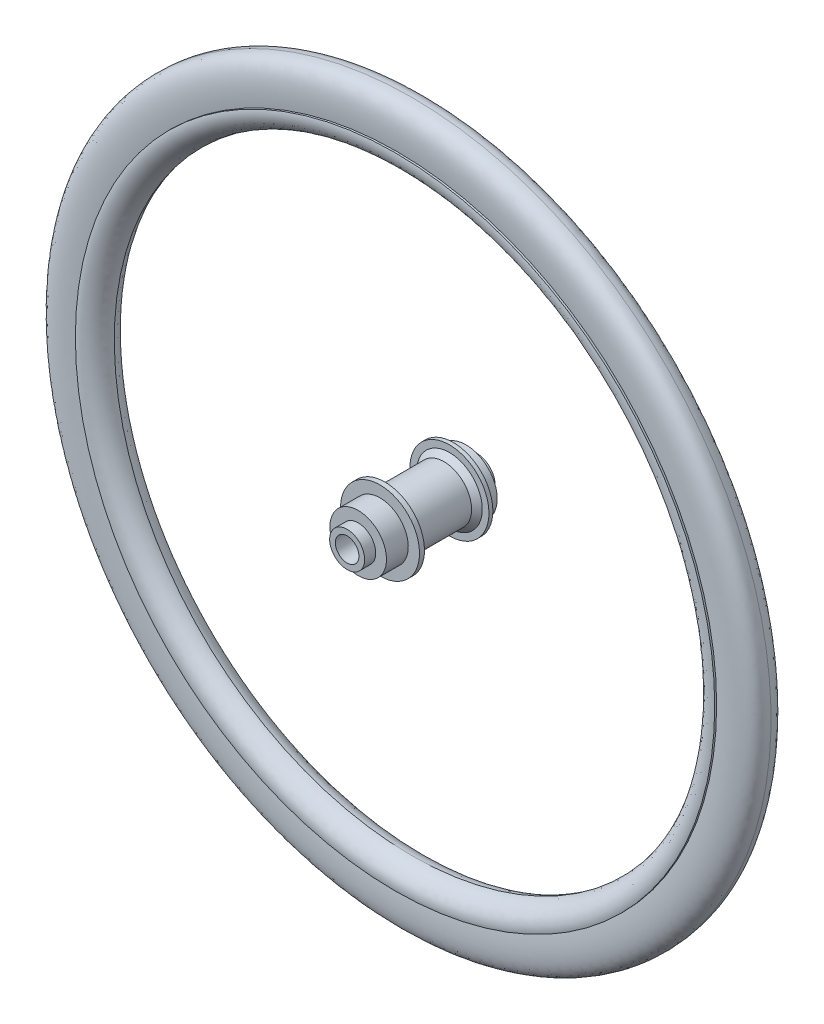
ISO-10303-21;
HEADER;
FILE_DESCRIPTION(('STEP AP214'),'2;1');
FILE_NAME('part.step','',(''),(''),'','','');
FILE_SCHEMA(('AUTOMOTIVE_DESIGN { 1 0 10303 214 1 1 1 1 }'));
ENDSEC;
DATA;
#1=APPLICATION_CONTEXT('core data for automotive mechanical design processes');
#2=APPLICATION_PROTOCOL_DEFINITION('international standard','automotive_design',2000,#1);
#3=PRODUCT_CONTEXT('',#1,'mechanical');
#4=PRODUCT('Part','Part','',(#3));
#5=PRODUCT_RELATED_PRODUCT_CATEGORY('part','',(#4));
#6=PRODUCT_DEFINITION_FORMATION('','',#4);
#7=PRODUCT_DEFINITION_CONTEXT('part definition',#1,'design');
#8=PRODUCT_DEFINITION('design','',#6,#7);
#9=PRODUCT_DEFINITION_SHAPE('','',#8);
#10=(LENGTH_UNIT() NAMED_UNIT(*) SI_UNIT(.MILLI.,.METRE.));
#11=(NAMED_UNIT(*) PLANE_ANGLE_UNIT() SI_UNIT($,.RADIAN.));
#12=(NAMED_UNIT(*) SI_UNIT($,.STERADIAN.) SOLID_ANGLE_UNIT());
#13=UNCERTAINTY_MEASURE_WITH_UNIT(LENGTH_MEASURE(1.E-05),#10,'distance_accuracy_value','');
#14=(GEOMETRIC_REPRESENTATION_CONTEXT(3) GLOBAL_UNCERTAINTY_ASSIGNED_CONTEXT((#13)) GLOBAL_UNIT_ASSIGNED_CONTEXT((#10,
#11,#12)) REPRESENTATION_CONTEXT('',''));
#15=CARTESIAN_POINT('',(0.,0.,0.));
#16=DIRECTION('',(0.,0.,1.));
#17=DIRECTION('',(1.,0.,0.));
#18=AXIS2_PLACEMENT_3D('',#15,#16,#17);
#19=CARTESIAN_POINT('',(0.,0.,127.));
#20=DIRECTION('',(0.,0.,1.));
#21=DIRECTION('',(0.,-1.,0.));
#22=AXIS2_PLACEMENT_3D('',#19,#20,#21);
#23=CYLINDRICAL_SURFACE('',#22,9.99999999999997);
#24=CARTESIAN_POINT('',(0.,0.,-55.));
#25=DIRECTION('',(0.,0.,1.));
#26=DIRECTION('',(0.,-1.,0.));
#27=AXIS2_PLACEMENT_3D('',#24,#25,#26);
#28=CIRCLE('',#27,9.99999999999996);
#29=CARTESIAN_POINT('',(0.,-9.99999999999993,-55.));
#30=VERTEX_POINT('',#29);
#31=EDGE_CURVE('E108',#30,#30,#28,.T.);
#32=ORIENTED_EDGE('',*,*,#31,.F.);
#33=EDGE_LOOP('',(#32));
#34=FACE_BOUND('',#33,.T.);
#35=CARTESIAN_POINT('',(0.,0.,55.));
#36=DIRECTION('',(0.,0.,1.));
#37=DIRECTION('',(0.,-1.,0.));
#38=AXIS2_PLACEMENT_3D('',#35,#36,#37);
#39=CIRCLE('',#38,9.99999999999998);
#40=CARTESIAN_POINT('',(0.,-9.99999999999997,55.));
#41=VERTEX_POINT('',#40);
#42=EDGE_CURVE('E11',#41,#41,#39,.T.);
#43=ORIENTED_EDGE('',*,*,#42,.T.);
#44=EDGE_LOOP('',(#43));
#45=FACE_BOUND('',#44,.T.);
#46=ADVANCED_FACE('F50',(#34,#45),#23,.F.);
#47=CARTESIAN_POINT('',(0.,9.99999999999999,55.));
#48=DIRECTION('',(0.,0.,-1.));
#49=DIRECTION('',(0.,1.,0.));
#50=AXIS2_PLACEMENT_3D('',#47,#48,#49);
#51=PLANE('',#50);
#52=ORIENTED_EDGE('',*,*,#42,.F.);
#53=EDGE_LOOP('',(#52));
#54=FACE_BOUND('',#53,.T.);
#55=CARTESIAN_POINT('',(0.,0.,55.));
#56=DIRECTION('',(0.,0.,1.));
#57=DIRECTION('',(0.,-1.,0.));
#58=AXIS2_PLACEMENT_3D('',#55,#56,#57);
#59=CIRCLE('',#58,14.8480622522296);
#60=CARTESIAN_POINT('',(0.,-14.8480622522296,55.));
#61=VERTEX_POINT('',#60);
#62=EDGE_CURVE('E56',#61,#61,#59,.T.);
#63=ORIENTED_EDGE('',*,*,#62,.T.);
#64=EDGE_LOOP('',(#63));
#65=FACE_BOUND('',#64,.T.);
#66=ADVANCED_FACE('F115',(#54,#65),#51,.F.);
#67=CARTESIAN_POINT('',(0.,0.,127.));
#68=DIRECTION('',(0.,0.,1.));
#69=DIRECTION('',(0.,-1.,0.));
#70=AXIS2_PLACEMENT_3D('',#67,#68,#69);
#71=CYLINDRICAL_SURFACE('',#70,14.8480622522296);
#72=ORIENTED_EDGE('',*,*,#62,.F.);
#73=EDGE_LOOP('',(#72));
#74=FACE_BOUND('',#73,.T.);
#75=CARTESIAN_POINT('',(0.,0.,45.5989190579238));
#76=DIRECTION('',(0.,0.,1.));
#77=DIRECTION('',(0.,-1.,0.));
#78=AXIS2_PLACEMENT_3D('',#75,#76,#77);
#79=CIRCLE('',#78,14.8480622522296);
#80=CARTESIAN_POINT('',(0.,-14.8480622522296,45.5989190579238));
#81=VERTEX_POINT('',#80);
#82=EDGE_CURVE('E60',#81,#81,#79,.T.);
#83=ORIENTED_EDGE('',*,*,#82,.T.);
#84=EDGE_LOOP('',(#83));
#85=FACE_BOUND('',#84,.T.);
#86=ADVANCED_FACE('F119',(#74,#85),#71,.T.);
#87=CARTESIAN_POINT('',(0.,14.8480622522296,45.5989190579238));
#88=DIRECTION('',(0.,0.,-1.));
#89=DIRECTION('',(0.,1.,0.));
#90=AXIS2_PLACEMENT_3D('',#87,#88,#89);
#91=PLANE('',#90);
#92=ORIENTED_EDGE('',*,*,#82,.F.);
#93=EDGE_LOOP('',(#92));
#94=FACE_BOUND('',#93,.T.);
#95=CARTESIAN_POINT('',(0.,0.,45.5989190579238));
#96=DIRECTION('',(0.,0.,1.));
#97=DIRECTION('',(0.,-1.,0.));
#98=AXIS2_PLACEMENT_3D('',#95,#96,#97);
#99=CIRCLE('',#98,24.0010203365637);
#100=CARTESIAN_POINT('',(0.,-24.0010203365637,45.5989190579238));
#101=VERTEX_POINT('',#100);
#102=EDGE_CURVE('E64',#101,#101,#99,.T.);
#103=ORIENTED_EDGE('',*,*,#102,.T.);
#104=EDGE_LOOP('',(#103));
#105=FACE_BOUND('',#104,.T.);
#106=ADVANCED_FACE('F124',(#94,#105),#91,.F.);
#107=CARTESIAN_POINT('',(0.,0.,127.));
#108=DIRECTION('',(0.,0.,1.));
#109=DIRECTION('',(0.,-1.,0.));
#110=AXIS2_PLACEMENT_3D('',#107,#108,#109);
#111=CYLINDRICAL_SURFACE('',#110,24.0010203365637);
#112=ORIENTED_EDGE('',*,*,#102,.F.);
#113=EDGE_LOOP('',(#112));
#114=FACE_BOUND('',#113,.T.);
#115=CARTESIAN_POINT('',(0.,0.,27.1106790233716));
#116=DIRECTION('',(0.,0.,1.));
#117=DIRECTION('',(0.,-1.,0.));
#118=AXIS2_PLACEMENT_3D('',#115,#116,#117);
#119=CIRCLE('',#118,24.0010203365637);
#120=CARTESIAN_POINT('',(0.,-24.0010203365637,27.1106790233716));
#121=VERTEX_POINT('',#120);
#122=EDGE_CURVE('E69',#121,#121,#119,.T.);
#123=ORIENTED_EDGE('',*,*,#122,.T.);
#124=EDGE_LOOP('',(#123));
#125=FACE_BOUND('',#124,.T.);
#126=ADVANCED_FACE('F130',(#114,#125),#111,.T.);
#127=CARTESIAN_POINT('',(0.,24.0010203365638,27.1106790233716));
#128=DIRECTION('',(0.,0.,-1.));
#129=DIRECTION('',(0.,1.,0.));
#130=AXIS2_PLACEMENT_3D('',#127,#128,#129);
#131=PLANE('',#130);
#132=ORIENTED_EDGE('',*,*,#122,.F.);
#133=EDGE_LOOP('',(#132));
#134=FACE_BOUND('',#133,.T.);
#135=CARTESIAN_POINT('',(0.,0.,27.1106790233716));
#136=DIRECTION('',(0.,0.,1.));
#137=DIRECTION('',(0.,-1.,0.));
#138=AXIS2_PLACEMENT_3D('',#135,#136,#137);
#139=CIRCLE('',#138,33.528);
#140=CARTESIAN_POINT('',(0.,-33.528,27.1106790233716));
#141=VERTEX_POINT('',#140);
#142=EDGE_CURVE('E72',#141,#141,#139,.T.);
#143=ORIENTED_EDGE('',*,*,#142,.T.);
#144=EDGE_LOOP('',(#143));
#145=FACE_BOUND('',#144,.T.);
#146=ADVANCED_FACE('F134',(#134,#145),#131,.F.);
#147=CARTESIAN_POINT('',(0.,0.,127.));
#148=DIRECTION('',(0.,0.,1.));
#149=DIRECTION('',(0.,-1.,0.));
#150=AXIS2_PLACEMENT_3D('',#147,#148,#149);
#151=CYLINDRICAL_SURFACE('',#150,33.528);
#152=ORIENTED_EDGE('',*,*,#142,.F.);
#153=EDGE_LOOP('',(#152));
#154=FACE_BOUND('',#153,.T.);
#155=CARTESIAN_POINT('',(0.,0.,22.8893209766284));
#156=DIRECTION('',(0.,0.,1.));
#157=DIRECTION('',(0.,-1.,0.));
#158=AXIS2_PLACEMENT_3D('',#155,#156,#157);
#159=CIRCLE('',#158,33.528);
#160=CARTESIAN_POINT('',(0.,-33.528,22.8893209766283));
#161=VERTEX_POINT('',#160);
#162=EDGE_CURVE('E75',#161,#161,#159,.T.);
#163=ORIENTED_EDGE('',*,*,#162,.T.);
#164=EDGE_LOOP('',(#163));
#165=FACE_BOUND('',#164,.T.);
#166=ADVANCED_FACE('F138',(#154,#165),#151,.T.);
#167=CARTESIAN_POINT('',(0.,33.528,22.8893209766284));
#168=DIRECTION('',(0.,0.,1.));
#169=DIRECTION('',(0.,-1.,0.));
#170=AXIS2_PLACEMENT_3D('',#167,#168,#169);
#171=PLANE('',#170);
#172=ORIENTED_EDGE('',*,*,#162,.F.);
#173=EDGE_LOOP('',(#172));
#174=FACE_BOUND('',#173,.T.);
#175=CARTESIAN_POINT('',(0.,0.,22.8893209766284));
#176=DIRECTION('',(0.,0.,1.));
#177=DIRECTION('',(0.,-1.,0.));
#178=AXIS2_PLACEMENT_3D('',#175,#176,#177);
#179=CIRCLE('',#178,27.859129332087);
#180=CARTESIAN_POINT('',(0.,-27.859129332087,22.8893209766283));
#181=VERTEX_POINT('',#180);
#182=EDGE_CURVE('E78',#181,#181,#179,.T.);
#183=ORIENTED_EDGE('',*,*,#182,.T.);
#184=EDGE_LOOP('',(#183));
#185=FACE_BOUND('',#184,.T.);
#186=ADVANCED_FACE('F142',(#174,#185),#171,.F.);
#187=CARTESIAN_POINT('',(0.,0.,18.6118031158684));
#188=DIRECTION('',(0.,0.,1.));
#189=DIRECTION('',(0.,-1.,0.));
#190=AXIS2_PLACEMENT_3D('',#187,#188,#189);
#191=CONICAL_SURFACE('',#190,23.4170915536055,0.804263849419123);
#192=ORIENTED_EDGE('',*,*,#182,.F.);
#193=EDGE_LOOP('',(#192));
#194=FACE_BOUND('',#193,.T.);
#195=CARTESIAN_POINT('',(0.,0.,18.6118031158684));
#196=DIRECTION('',(0.,0.,1.));
#197=DIRECTION('',(0.,-1.,0.));
#198=AXIS2_PLACEMENT_3D('',#195,#196,#197);
#199=CIRCLE('',#198,23.4170915536055);
#200=CARTESIAN_POINT('',(0.,-23.4170915536055,18.6118031158684));
#201=VERTEX_POINT('',#200);
#202=EDGE_CURVE('E81',#201,#201,#199,.T.);
#203=ORIENTED_EDGE('',*,*,#202,.T.);
#204=EDGE_LOOP('',(#203));
#205=FACE_BOUND('',#204,.T.);
#206=ADVANCED_FACE('F146',(#194,#205),#191,.T.);
#207=CARTESIAN_POINT('',(0.,0.,127.));
#208=DIRECTION('',(0.,0.,1.));
#209=DIRECTION('',(0.,-1.,0.));
#210=AXIS2_PLACEMENT_3D('',#207,#208,#209);
#211=CYLINDRICAL_SURFACE('',#210,23.4170915536055);
#212=ORIENTED_EDGE('',*,*,#202,.F.);
#213=EDGE_LOOP('',(#212));
#214=FACE_BOUND('',#213,.T.);
#215=CARTESIAN_POINT('',(0.,0.,-27.2240530794285));
#216=DIRECTION('',(0.,0.,1.));
#217=DIRECTION('',(0.,-1.,0.));
#218=AXIS2_PLACEMENT_3D('',#215,#216,#217);
#219=CIRCLE('',#218,23.4170915536055);
#220=CARTESIAN_POINT('',(0.,-23.4170915536055,-27.2240530794285));
#221=VERTEX_POINT('',#220);
#222=EDGE_CURVE('E84',#221,#221,#219,.T.);
#223=ORIENTED_EDGE('',*,*,#222,.T.);
#224=EDGE_LOOP('',(#223));
#225=FACE_BOUND('',#224,.T.);
#226=ADVANCED_FACE('F150',(#214,#225),#211,.T.);
#227=CARTESIAN_POINT('',(0.,0.,-31.8369384647747));
#228=DIRECTION('',(0.,0.,-1.));
#229=DIRECTION('',(0.,1.,0.));
#230=AXIS2_PLACEMENT_3D('',#227,#228,#229);
#231=CONICAL_SURFACE('',#230,27.859129332087,0.766532477375775);
#232=ORIENTED_EDGE('',*,*,#222,.F.);
#233=EDGE_LOOP('',(#232));
#234=FACE_BOUND('',#233,.T.);
#235=CARTESIAN_POINT('',(0.,0.,-31.8369384647747));
#236=DIRECTION('',(0.,0.,1.));
#237=DIRECTION('',(0.,-1.,0.));
#238=AXIS2_PLACEMENT_3D('',#235,#236,#237);
#239=CIRCLE('',#238,27.859129332087);
#240=CARTESIAN_POINT('',(0.,-27.859129332087,-31.8369384647747));
#241=VERTEX_POINT('',#240);
#242=EDGE_CURVE('E87',#241,#241,#239,.T.);
#243=ORIENTED_EDGE('',*,*,#242,.T.);
#244=EDGE_LOOP('',(#243));
#245=FACE_BOUND('',#244,.T.);
#246=ADVANCED_FACE('F154',(#234,#245),#231,.T.);
#247=CARTESIAN_POINT('',(0.,27.859129332087,-31.8369384647747));
#248=DIRECTION('',(0.,0.,-1.));
#249=DIRECTION('',(0.,1.,0.));
#250=AXIS2_PLACEMENT_3D('',#247,#248,#249);
#251=PLANE('',#250);
#252=ORIENTED_EDGE('',*,*,#242,.F.);
#253=EDGE_LOOP('',(#252));
#254=FACE_BOUND('',#253,.T.);
#255=CARTESIAN_POINT('',(0.,0.,-31.8369384647747));
#256=DIRECTION('',(0.,0.,1.));
#257=DIRECTION('',(0.,-1.,0.));
#258=AXIS2_PLACEMENT_3D('',#255,#256,#257);
#259=CIRCLE('',#258,33.528);
#260=CARTESIAN_POINT('',(0.,-33.5279999999999,-31.8369384647747));
#261=VERTEX_POINT('',#260);
#262=EDGE_CURVE('E90',#261,#261,#259,.T.);
#263=ORIENTED_EDGE('',*,*,#262,.T.);
#264=EDGE_LOOP('',(#263));
#265=FACE_BOUND('',#264,.T.);
#266=ADVANCED_FACE('F158',(#254,#265),#251,.F.);
#267=CARTESIAN_POINT('',(0.,0.,127.));
#268=DIRECTION('',(0.,0.,1.));
#269=DIRECTION('',(0.,-1.,0.));
#270=AXIS2_PLACEMENT_3D('',#267,#268,#269);
#271=CYLINDRICAL_SURFACE('',#270,33.528);
#272=ORIENTED_EDGE('',*,*,#262,.F.);
#273=EDGE_LOOP('',(#272));
#274=FACE_BOUND('',#273,.T.);
#275=CARTESIAN_POINT('',(0.,0.,-35.1630615352253));
#276=DIRECTION('',(0.,0.,1.));
#277=DIRECTION('',(0.,-1.,0.));
#278=AXIS2_PLACEMENT_3D('',#275,#276,#277);
#279=CIRCLE('',#278,33.528);
#280=CARTESIAN_POINT('',(0.,-33.5279999999999,-35.1630615352253));
#281=VERTEX_POINT('',#280);
#282=EDGE_CURVE('E93',#281,#281,#279,.T.);
#283=ORIENTED_EDGE('',*,*,#282,.T.);
#284=EDGE_LOOP('',(#283));
#285=FACE_BOUND('',#284,.T.);
#286=ADVANCED_FACE('F162',(#274,#285),#271,.T.);
#287=CARTESIAN_POINT('',(0.,33.528,-35.1630615352253));
#288=DIRECTION('',(0.,0.,1.));
#289=DIRECTION('',(0.,-1.,0.));
#290=AXIS2_PLACEMENT_3D('',#287,#288,#289);
#291=PLANE('',#290);
#292=ORIENTED_EDGE('',*,*,#282,.F.);
#293=EDGE_LOOP('',(#292));
#294=FACE_BOUND('',#293,.T.);
#295=CARTESIAN_POINT('',(0.,0.,-35.1630615352253));
#296=DIRECTION('',(0.,0.,1.));
#297=DIRECTION('',(0.,-1.,0.));
#298=AXIS2_PLACEMENT_3D('',#295,#296,#297);
#299=CIRCLE('',#298,26.4824605876279);
#300=CARTESIAN_POINT('',(0.,-26.4824605876279,-35.1630615352253));
#301=VERTEX_POINT('',#300);
#302=EDGE_CURVE('E96',#301,#301,#299,.T.);
#303=ORIENTED_EDGE('',*,*,#302,.T.);
#304=EDGE_LOOP('',(#303));
#305=FACE_BOUND('',#304,.T.);
#306=ADVANCED_FACE('F166',(#294,#305),#291,.F.);
#307=CARTESIAN_POINT('',(0.,0.,127.));
#308=DIRECTION('',(0.,0.,1.));
#309=DIRECTION('',(0.,-1.,0.));
#310=AXIS2_PLACEMENT_3D('',#307,#308,#309);
#311=CYLINDRICAL_SURFACE('',#310,26.4824605876279);
#312=ORIENTED_EDGE('',*,*,#302,.F.);
#313=EDGE_LOOP('',(#312));
#314=FACE_BOUND('',#313,.T.);
#315=CARTESIAN_POINT('',(0.,0.,-45.9028967622712));
#316=DIRECTION('',(0.,0.,1.));
#317=DIRECTION('',(0.,-1.,0.));
#318=AXIS2_PLACEMENT_3D('',#315,#316,#317);
#319=CIRCLE('',#318,26.4824605876279);
#320=CARTESIAN_POINT('',(0.,-26.4824605876279,-45.9028967622712));
#321=VERTEX_POINT('',#320);
#322=EDGE_CURVE('E99',#321,#321,#319,.T.);
#323=ORIENTED_EDGE('',*,*,#322,.T.);
#324=EDGE_LOOP('',(#323));
#325=FACE_BOUND('',#324,.T.);
#326=ADVANCED_FACE('F170',(#314,#325),#311,.T.);
#327=CARTESIAN_POINT('',(0.,26.482460587628,-45.9028967622712));
#328=DIRECTION('',(0.,0.,1.));
#329=DIRECTION('',(0.,-1.,0.));
#330=AXIS2_PLACEMENT_3D('',#327,#328,#329);
#331=PLANE('',#330);
#332=ORIENTED_EDGE('',*,*,#322,.F.);
#333=EDGE_LOOP('',(#332));
#334=FACE_BOUND('',#333,.T.);
#335=CARTESIAN_POINT('',(0.,0.,-45.9028967622712));
#336=DIRECTION('',(0.,0.,1.));
#337=DIRECTION('',(0.,-1.,0.));
#338=AXIS2_PLACEMENT_3D('',#335,#336,#337);
#339=CIRCLE('',#338,15.7043163310257);
#340=CARTESIAN_POINT('',(0.,-15.7043163310257,-45.9028967622712));
#341=VERTEX_POINT('',#340);
#342=EDGE_CURVE('E102',#341,#341,#339,.T.);
#343=ORIENTED_EDGE('',*,*,#342,.T.);
#344=EDGE_LOOP('',(#343));
#345=FACE_BOUND('',#344,.T.);
#346=ADVANCED_FACE('F174',(#334,#345),#331,.F.);
#347=CARTESIAN_POINT('',(0.,0.,127.));
#348=DIRECTION('',(0.,0.,1.));
#349=DIRECTION('',(0.,-1.,0.));
#350=AXIS2_PLACEMENT_3D('',#347,#348,#349);
#351=CYLINDRICAL_SURFACE('',#350,15.7043163310257);
#352=ORIENTED_EDGE('',*,*,#342,.F.);
#353=EDGE_LOOP('',(#352));
#354=FACE_BOUND('',#353,.T.);
#355=CARTESIAN_POINT('',(0.,0.,-55.));
#356=DIRECTION('',(0.,0.,1.));
#357=DIRECTION('',(0.,-1.,0.));
#358=AXIS2_PLACEMENT_3D('',#355,#356,#357);
#359=CIRCLE('',#358,15.7043163310257);
#360=CARTESIAN_POINT('',(0.,-15.7043163310257,-55.));
#361=VERTEX_POINT('',#360);
#362=EDGE_CURVE('E105',#361,#361,#359,.T.);
#363=ORIENTED_EDGE('',*,*,#362,.T.);
#364=EDGE_LOOP('',(#363));
#365=FACE_BOUND('',#364,.T.);
#366=ADVANCED_FACE('F178',(#354,#365),#351,.T.);
#367=CARTESIAN_POINT('',(0.,15.7043163310258,-55.));
#368=DIRECTION('',(0.,0.,1.));
#369=DIRECTION('',(0.,-1.,0.));
#370=AXIS2_PLACEMENT_3D('',#367,#368,#369);
#371=PLANE('',#370);
#372=ORIENTED_EDGE('',*,*,#362,.F.);
#373=EDGE_LOOP('',(#372));
#374=FACE_BOUND('',#373,.T.);
#375=ORIENTED_EDGE('',*,*,#31,.T.);
#376=EDGE_LOOP('',(#375));
#377=FACE_BOUND('',#376,.T.);
#378=ADVANCED_FACE('F112',(#374,#377),#371,.F.);
#379=CLOSED_SHELL('',(#46,#66,#86,#106,#126,#146,#166,#186,#206,#226,#246,#266,#286,#306,#326,
#346,#366,#378));
#380=MANIFOLD_SOLID_BREP('B2',#379);
#381=CARTESIAN_POINT('',(0.,0.,127.));
#382=DIRECTION('',(0.,0.,1.));
#383=DIRECTION('',(0.,-1.,0.));
#384=AXIS2_PLACEMENT_3D('',#381,#382,#383);
#385=CYLINDRICAL_SURFACE('',#384,271.349373606938);
#386=CARTESIAN_POINT('',(0.,0.,14.3318406287482));
#387=DIRECTION('',(0.,0.,1.));
#388=DIRECTION('',(0.,-1.,0.));
#389=AXIS2_PLACEMENT_3D('',#386,#387,#388);
#390=CIRCLE('',#389,271.349373606938);
#391=CARTESIAN_POINT('',(0.,-271.349373606938,14.3318406287481));
#392=VERTEX_POINT('',#391);
#393=EDGE_CURVE('E375',#392,#392,#390,.T.);
#394=ORIENTED_EDGE('',*,*,#393,.F.);
#395=EDGE_LOOP('',(#394));
#396=FACE_BOUND('',#395,.T.);
#397=CARTESIAN_POINT('',(0.,0.,12.7175438252798));
#398=DIRECTION('',(0.,0.,1.));
#399=DIRECTION('',(0.,-1.,0.));
#400=AXIS2_PLACEMENT_3D('',#397,#398,#399);
#401=CIRCLE('',#400,271.349373606938);
#402=CARTESIAN_POINT('',(0.,-271.349373606938,12.7175438252797));
#403=VERTEX_POINT('',#402);
#404=EDGE_CURVE('E49',#403,#403,#401,.T.);
#405=ORIENTED_EDGE('',*,*,#404,.T.);
#406=EDGE_LOOP('',(#405));
#407=FACE_BOUND('',#406,.T.);
#408=ADVANCED_FACE('F358',(#396,#407),#385,.T.);
#409=CARTESIAN_POINT('',(0.,0.,-14.3318406287483));
#410=DIRECTION('',(0.,0.,1.));
#411=DIRECTION('',(0.,-1.,0.));
#412=AXIS2_PLACEMENT_3D('',#409,#410,#411);
#413=CIRCLE('',#412,271.349373606938);
#414=CARTESIAN_POINT('',(0.,-271.349373606938,-14.3318406287483));
#415=VERTEX_POINT('',#414);
#416=EDGE_CURVE('E435',#415,#415,#413,.T.);
#417=ORIENTED_EDGE('',*,*,#416,.T.);
#418=EDGE_LOOP('',(#417));
#419=FACE_BOUND('',#418,.T.);
#420=CARTESIAN_POINT('',(0.,0.,-12.7175438252799));
#421=DIRECTION('',(0.,0.,1.));
#422=DIRECTION('',(0.,-1.,0.));
#423=AXIS2_PLACEMENT_3D('',#420,#421,#422);
#424=CIRCLE('',#423,271.349373606938);
#425=CARTESIAN_POINT('',(0.,-271.349373606938,-12.7175438252799));
#426=VERTEX_POINT('',#425);
#427=EDGE_CURVE('E363',#426,#426,#424,.F.);
#428=ORIENTED_EDGE('',*,*,#427,.T.);
#429=EDGE_LOOP('',(#428));
#430=FACE_BOUND('',#429,.T.);
#431=ADVANCED_FACE('F399',(#419,#430),#385,.T.);
#432=CARTESIAN_POINT('',(0.,271.349373606938,14.3318406287482));
#433=CARTESIAN_POINT('',(0.,262.359742007139,16.5518532320006));
#434=CARTESIAN_POINT('',(0.,253.33707255614,8.76414383492793));
#435=CARTESIAN_POINT('',(0.,252.62813020854,0.));
#436=B_SPLINE_CURVE_WITH_KNOTS('',3,(#432,#433,#434,#435),.UNSPECIFIED.,.F.,.F.,(4,4),(0.,1.),.UNSPECIFIED.);
#437=CARTESIAN_POINT('',(0.,0.,127.));
#438=DIRECTION('',(0.,0.,1.));
#439=AXIS1_PLACEMENT('',#437,#438);
#440=SURFACE_OF_REVOLUTION('',#436,#439);
#441=CARTESIAN_POINT('',(0.,0.,0.));
#442=DIRECTION('',(0.,0.,1.));
#443=DIRECTION('',(0.,-1.,0.));
#444=AXIS2_PLACEMENT_3D('',#441,#442,#443);
#445=CIRCLE('',#444,252.62813020854);
#446=CARTESIAN_POINT('',(0.,-252.62813020854,-1.02095712650359E-13));
#447=VERTEX_POINT('',#446);
#448=EDGE_CURVE('E413',#447,#447,#445,.T.);
#449=ORIENTED_EDGE('',*,*,#448,.F.);
#450=EDGE_LOOP('',(#449));
#451=FACE_BOUND('',#450,.T.);
#452=ORIENTED_EDGE('',*,*,#393,.T.);
#453=EDGE_LOOP('',(#452));
#454=FACE_BOUND('',#453,.T.);
#455=ADVANCED_FACE('F394',(#451,#454),#440,.T.);
#456=CARTESIAN_POINT('',(0.,252.62813020854,0.));
#457=CARTESIAN_POINT('',(0.,253.33707255614,-8.76414383492793));
#458=CARTESIAN_POINT('',(0.,262.359742007139,-16.5518532320006));
#459=CARTESIAN_POINT('',(0.,271.349373606938,-14.3318406287482));
#460=B_SPLINE_CURVE_WITH_KNOTS('',3,(#456,#457,#458,#459),.UNSPECIFIED.,.F.,.F.,(4,4),(0.,1.),.UNSPECIFIED.);
#461=CARTESIAN_POINT('',(0.,0.,127.));
#462=DIRECTION('',(0.,0.,1.));
#463=AXIS1_PLACEMENT('',#461,#462);
#464=SURFACE_OF_REVOLUTION('',#460,#463);
#465=ORIENTED_EDGE('',*,*,#416,.F.);
#466=EDGE_LOOP('',(#465));
#467=FACE_BOUND('',#466,.T.);
#468=ORIENTED_EDGE('',*,*,#448,.T.);
#469=EDGE_LOOP('',(#468));
#470=FACE_BOUND('',#469,.T.);
#471=ADVANCED_FACE('F398',(#467,#470),#464,.T.);
#472=CARTESIAN_POINT('',(0.,304.8,0.));
#473=CARTESIAN_POINT('',(0.,304.713103163001,3.10578123349127));
#474=CARTESIAN_POINT('',(0.,304.290095567265,4.78698729331975));
#475=CARTESIAN_POINT('',(0.,303.461281857496,6.53454409651057));
#476=CARTESIAN_POINT('',(0.,298.659601338602,16.7231465799408));
#477=CARTESIAN_POINT('',(0.,269.8,12.4999999999999));
#478=B_SPLINE_CURVE_WITH_KNOTS('',3,(#472,#473,#474,#475,#476,#477),.UNSPECIFIED.,.F.,.F.,(4,1,
1,4),(0.,0.441572013078017,0.519847254716948,1.),.UNSPECIFIED.);
#479=CARTESIAN_POINT('',(0.,0.,127.));
#480=DIRECTION('',(0.,0.,1.));
#481=AXIS1_PLACEMENT('',#479,#480);
#482=SURFACE_OF_REVOLUTION('',#478,#481);
#483=CARTESIAN_POINT('',(0.,0.,0.));
#484=DIRECTION('',(0.,0.,1.));
#485=DIRECTION('',(0.,-1.,0.));
#486=AXIS2_PLACEMENT_3D('',#483,#484,#485);
#487=CIRCLE('',#486,304.8);
#488=CARTESIAN_POINT('',(0.,-304.8,-1.11716191852906E-13));
#489=VERTEX_POINT('',#488);
#490=EDGE_CURVE('E373',#489,#489,#487,.T.);
#491=ORIENTED_EDGE('',*,*,#490,.T.);
#492=EDGE_LOOP('',(#491));
#493=FACE_BOUND('',#492,.T.);
#494=ORIENTED_EDGE('',*,*,#404,.F.);
#495=EDGE_LOOP('',(#494));
#496=FACE_BOUND('',#495,.T.);
#497=ADVANCED_FACE('F360',(#493,#496),#482,.T.);
#498=CARTESIAN_POINT('',(0.,269.8,-12.4999999999999));
#499=CARTESIAN_POINT('',(0.,298.659601338602,-16.7231465799408));
#500=CARTESIAN_POINT('',(0.,303.461281857496,-6.53454409651057));
#501=CARTESIAN_POINT('',(0.,304.290095567265,-4.78698729331975));
#502=CARTESIAN_POINT('',(0.,304.713103163001,-3.10578123349127));
#503=CARTESIAN_POINT('',(0.,304.8,0.));
#504=B_SPLINE_CURVE_WITH_KNOTS('',3,(#498,#499,#500,#501,#502,#503),.UNSPECIFIED.,.F.,.F.,(4,1,
1,4),(0.,0.480152745283052,0.558427986921983,1.),.UNSPECIFIED.);
#505=CARTESIAN_POINT('',(0.,0.,127.));
#506=DIRECTION('',(0.,0.,1.));
#507=AXIS1_PLACEMENT('',#505,#506);
#508=SURFACE_OF_REVOLUTION('',#504,#507);
#509=ORIENTED_EDGE('',*,*,#490,.F.);
#510=EDGE_LOOP('',(#509));
#511=FACE_BOUND('',#510,.T.);
#512=ORIENTED_EDGE('',*,*,#427,.F.);
#513=EDGE_LOOP('',(#512));
#514=FACE_BOUND('',#513,.T.);
#515=ADVANCED_FACE('F390',(#511,#514),#508,.T.);
#516=CLOSED_SHELL('',(#408,#431,#455,#471,#497,#515));
#517=MANIFOLD_SOLID_BREP('B6',#516);
#518=ADVANCED_BREP_SHAPE_REPRESENTATION('',(#18,#380,#517),#14);
#519=SHAPE_DEFINITION_REPRESENTATION(#9,#518);
ENDSEC;
END-ISO-10303-21;
